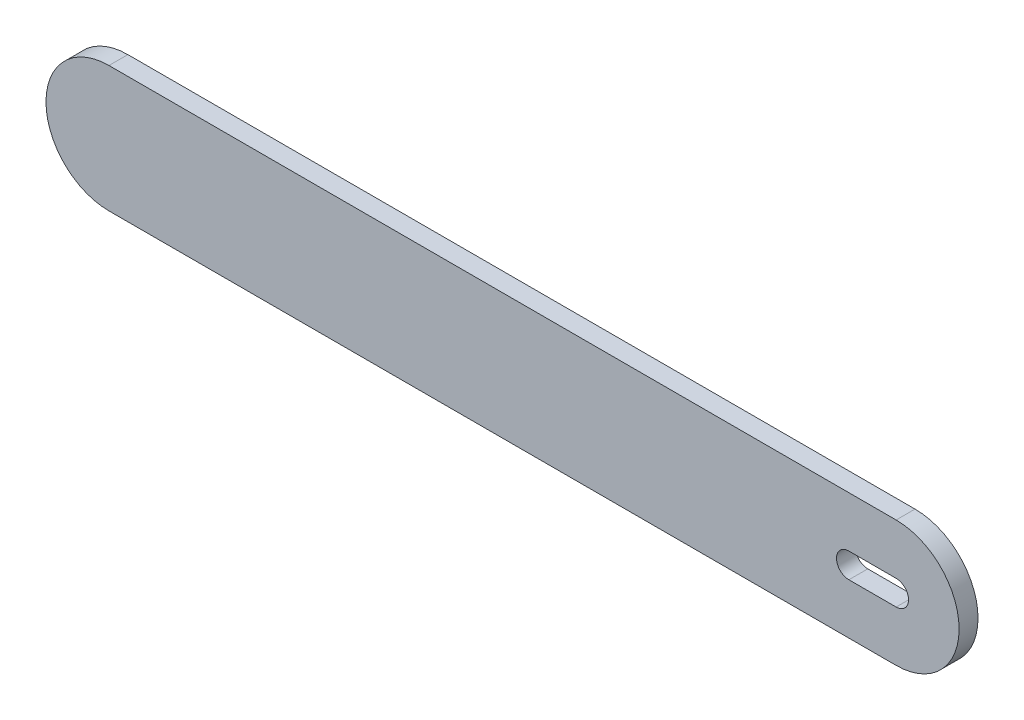
ISO-10303-21;
HEADER;
FILE_DESCRIPTION(('STEP AP214'),'2;1');
FILE_NAME('part.step','',(''),(''),'','','');
FILE_SCHEMA(('AUTOMOTIVE_DESIGN { 1 0 10303 214 1 1 1 1 }'));
ENDSEC;
DATA;
#1=APPLICATION_CONTEXT('core data for automotive mechanical design processes');
#2=APPLICATION_PROTOCOL_DEFINITION('international standard','automotive_design',2000,#1);
#3=PRODUCT_CONTEXT('',#1,'mechanical');
#4=PRODUCT('Part','Part','',(#3));
#5=PRODUCT_RELATED_PRODUCT_CATEGORY('part','',(#4));
#6=PRODUCT_DEFINITION_FORMATION('','',#4);
#7=PRODUCT_DEFINITION_CONTEXT('part definition',#1,'design');
#8=PRODUCT_DEFINITION('design','',#6,#7);
#9=PRODUCT_DEFINITION_SHAPE('','',#8);
#10=(LENGTH_UNIT() NAMED_UNIT(*) SI_UNIT(.MILLI.,.METRE.));
#11=(NAMED_UNIT(*) PLANE_ANGLE_UNIT() SI_UNIT($,.RADIAN.));
#12=(NAMED_UNIT(*) SI_UNIT($,.STERADIAN.) SOLID_ANGLE_UNIT());
#13=UNCERTAINTY_MEASURE_WITH_UNIT(LENGTH_MEASURE(1.E-05),#10,'distance_accuracy_value','');
#14=(GEOMETRIC_REPRESENTATION_CONTEXT(3) GLOBAL_UNCERTAINTY_ASSIGNED_CONTEXT((#13)) GLOBAL_UNIT_ASSIGNED_CONTEXT((#10,
#11,#12)) REPRESENTATION_CONTEXT('',''));
#15=CARTESIAN_POINT('',(0.,0.,0.));
#16=DIRECTION('',(0.,0.,1.));
#17=DIRECTION('',(1.,0.,0.));
#18=AXIS2_PLACEMENT_3D('',#15,#16,#17);
#19=CARTESIAN_POINT('',(-53.15,-0.367507574945572,6.));
#20=DIRECTION('',(0.,0.,-1.));
#21=DIRECTION('',(-1.,0.,0.));
#22=AXIS2_PLACEMENT_3D('',#19,#20,#21);
#23=CYLINDRICAL_SURFACE('',#22,20.);
#24=CARTESIAN_POINT('',(-53.15,-0.367507574945572,0.));
#25=DIRECTION('',(0.,0.,1.));
#26=DIRECTION('',(-1.,0.,0.));
#27=AXIS2_PLACEMENT_3D('',#24,#25,#26);
#28=CIRCLE('',#27,20.);
#29=CARTESIAN_POINT('',(-53.1499966396759,-20.3675075749453,0.));
#30=VERTEX_POINT('',#29);
#31=CARTESIAN_POINT('',(-53.1499966396758,19.6324924250541,0.));
#32=VERTEX_POINT('',#31);
#33=EDGE_CURVE('E119',#30,#32,#28,.T.);
#34=ORIENTED_EDGE('',*,*,#33,.T.);
#35=DIRECTION('',(0.,0.,-1.));
#36=VECTOR('',#35,1.);
#37=CARTESIAN_POINT('',(-53.1499966396758,19.6324924250541,6.));
#38=LINE('',#37,#36);
#39=CARTESIAN_POINT('',(-53.1499966396758,19.6324924250541,6.));
#40=VERTEX_POINT('',#39);
#41=EDGE_CURVE('E11',#40,#32,#38,.T.);
#42=ORIENTED_EDGE('',*,*,#41,.F.);
#43=CARTESIAN_POINT('',(-53.15,-0.367507574945572,6.));
#44=DIRECTION('',(0.,0.,1.));
#45=DIRECTION('',(-1.,0.,0.));
#46=AXIS2_PLACEMENT_3D('',#43,#44,#45);
#47=CIRCLE('',#46,20.);
#48=CARTESIAN_POINT('',(-53.1499966396759,-20.3675075749453,6.));
#49=VERTEX_POINT('',#48);
#50=EDGE_CURVE('E142',#49,#40,#47,.T.);
#51=ORIENTED_EDGE('',*,*,#50,.F.);
#52=DIRECTION('',(0.,0.,-1.));
#53=VECTOR('',#52,1.);
#54=CARTESIAN_POINT('',(-53.1499966396759,-20.3675075749453,6.));
#55=LINE('',#54,#53);
#56=EDGE_CURVE('E152',#49,#30,#55,.T.);
#57=ORIENTED_EDGE('',*,*,#56,.T.);
#58=EDGE_LOOP('',(#34,#42,#51,#57));
#59=FACE_BOUND('',#58,.T.);
#60=ADVANCED_FACE('F41',(#59),#23,.T.);
#61=CARTESIAN_POINT('',(-303.15,19.6324924250547,6.));
#62=DIRECTION('',(0.,-1.,0.));
#63=DIRECTION('',(1.,0.,0.));
#64=AXIS2_PLACEMENT_3D('',#61,#62,#63);
#65=PLANE('',#64);
#66=DIRECTION('',(-1.,0.,0.));
#67=VECTOR('',#66,1.);
#68=CARTESIAN_POINT('',(-303.15,19.6324924250547,0.));
#69=LINE('',#68,#67);
#70=CARTESIAN_POINT('',(-303.15,19.6324924250548,0.));
#71=VERTEX_POINT('',#70);
#72=EDGE_CURVE('E155',#32,#71,#69,.T.);
#73=ORIENTED_EDGE('',*,*,#72,.T.);
#74=DIRECTION('',(0.,0.,-1.));
#75=VECTOR('',#74,1.);
#76=CARTESIAN_POINT('',(-303.15,19.6324924250548,6.));
#77=LINE('',#76,#75);
#78=CARTESIAN_POINT('',(-303.15,19.6324924250548,6.));
#79=VERTEX_POINT('',#78);
#80=EDGE_CURVE('E48',#79,#71,#77,.T.);
#81=ORIENTED_EDGE('',*,*,#80,.F.);
#82=DIRECTION('',(-1.,0.,0.));
#83=VECTOR('',#82,1.);
#84=CARTESIAN_POINT('',(-303.15,19.6324924250547,6.));
#85=LINE('',#84,#83);
#86=EDGE_CURVE('E145',#40,#79,#85,.T.);
#87=ORIENTED_EDGE('',*,*,#86,.F.);
#88=ORIENTED_EDGE('',*,*,#41,.T.);
#89=EDGE_LOOP('',(#73,#81,#87,#88));
#90=FACE_BOUND('',#89,.T.);
#91=ADVANCED_FACE('F183',(#90),#65,.F.);
#92=CARTESIAN_POINT('',(-303.15,-0.367507574945326,6.));
#93=DIRECTION('',(0.,0.,-1.));
#94=DIRECTION('',(-1.,0.,0.));
#95=AXIS2_PLACEMENT_3D('',#92,#93,#94);
#96=CYLINDRICAL_SURFACE('',#95,20.0000000000001);
#97=CARTESIAN_POINT('',(-303.15,-0.367507574945326,0.));
#98=DIRECTION('',(0.,0.,1.));
#99=DIRECTION('',(-1.,0.,0.));
#100=AXIS2_PLACEMENT_3D('',#97,#98,#99);
#101=CIRCLE('',#100,20.0000000000001);
#102=CARTESIAN_POINT('',(-303.15,-20.3675075749456,0.));
#103=VERTEX_POINT('',#102);
#104=EDGE_CURVE('E157',#71,#103,#101,.T.);
#105=ORIENTED_EDGE('',*,*,#104,.T.);
#106=DIRECTION('',(0.,0.,-1.));
#107=VECTOR('',#106,1.);
#108=CARTESIAN_POINT('',(-303.15,-20.3675075749456,6.));
#109=LINE('',#108,#107);
#110=CARTESIAN_POINT('',(-303.15,-20.3675075749456,6.));
#111=VERTEX_POINT('',#110);
#112=EDGE_CURVE('E162',#111,#103,#109,.T.);
#113=ORIENTED_EDGE('',*,*,#112,.F.);
#114=CARTESIAN_POINT('',(-303.15,-0.367507574945326,6.));
#115=DIRECTION('',(0.,0.,1.));
#116=DIRECTION('',(-1.,0.,0.));
#117=AXIS2_PLACEMENT_3D('',#114,#115,#116);
#118=CIRCLE('',#117,20.0000000000001);
#119=EDGE_CURVE('E148',#79,#111,#118,.T.);
#120=ORIENTED_EDGE('',*,*,#119,.F.);
#121=ORIENTED_EDGE('',*,*,#80,.T.);
#122=EDGE_LOOP('',(#105,#113,#120,#121));
#123=FACE_BOUND('',#122,.T.);
#124=ADVANCED_FACE('F169',(#123),#96,.T.);
#125=CARTESIAN_POINT('',(-53.1499966396759,-20.3675075749453,6.));
#126=DIRECTION('',(0.,1.,0.));
#127=DIRECTION('',(-1.,0.,0.));
#128=AXIS2_PLACEMENT_3D('',#125,#126,#127);
#129=PLANE('',#128);
#130=DIRECTION('',(1.,0.,0.));
#131=VECTOR('',#130,1.);
#132=CARTESIAN_POINT('',(-53.1499966396759,-20.3675075749453,0.));
#133=LINE('',#132,#131);
#134=EDGE_CURVE('E146',#103,#30,#133,.T.);
#135=ORIENTED_EDGE('',*,*,#134,.T.);
#136=ORIENTED_EDGE('',*,*,#56,.F.);
#137=DIRECTION('',(1.,0.,0.));
#138=VECTOR('',#137,1.);
#139=CARTESIAN_POINT('',(-53.1499966396759,-20.3675075749453,6.));
#140=LINE('',#139,#138);
#141=EDGE_CURVE('E150',#111,#49,#140,.T.);
#142=ORIENTED_EDGE('',*,*,#141,.F.);
#143=ORIENTED_EDGE('',*,*,#112,.T.);
#144=EDGE_LOOP('',(#135,#136,#142,#143));
#145=FACE_BOUND('',#144,.T.);
#146=ADVANCED_FACE('F178',(#145),#129,.F.);
#147=CARTESIAN_POINT('',(-53.15,-0.367507574945572,6.));
#148=DIRECTION('',(0.,0.,-1.));
#149=DIRECTION('',(-1.,0.,0.));
#150=AXIS2_PLACEMENT_3D('',#147,#148,#149);
#151=PLANE('',#150);
#152=DIRECTION('',(-1.,0.,0.));
#153=VECTOR('',#152,1.);
#154=CARTESIAN_POINT('',(-53.1500000000005,3.57626302207883,6.));
#155=LINE('',#154,#153);
#156=CARTESIAN_POINT('',(-53.1500000000005,3.57626302207883,6.));
#157=VERTEX_POINT('',#156);
#158=CARTESIAN_POINT('',(-68.1500000000005,3.57626302207883,6.));
#159=VERTEX_POINT('',#158);
#160=EDGE_CURVE('E125',#157,#159,#155,.T.);
#161=ORIENTED_EDGE('',*,*,#160,.F.);
#162=CARTESIAN_POINT('',(-53.1500000000009,-0.367507574945548,6.));
#163=DIRECTION('',(0.,0.,-1.));
#164=DIRECTION('',(-1.,0.,0.));
#165=AXIS2_PLACEMENT_3D('',#162,#163,#164);
#166=CIRCLE('',#165,3.9437705970244);
#167=CARTESIAN_POINT('',(-53.1500000000005,-4.31127817196997,6.));
#168=VERTEX_POINT('',#167);
#169=EDGE_CURVE('E107',#168,#157,#166,.F.);
#170=ORIENTED_EDGE('',*,*,#169,.F.);
#171=DIRECTION('',(1.,0.,0.));
#172=VECTOR('',#171,1.);
#173=CARTESIAN_POINT('',(-53.1500000000005,-4.31127817196997,6.));
#174=LINE('',#173,#172);
#175=CARTESIAN_POINT('',(-68.1500000000005,-4.31127817196997,6.));
#176=VERTEX_POINT('',#175);
#177=EDGE_CURVE('E116',#176,#168,#174,.T.);
#178=ORIENTED_EDGE('',*,*,#177,.F.);
#179=CARTESIAN_POINT('',(-68.1500000000005,-0.367507574945572,6.));
#180=DIRECTION('',(0.,0.,-1.));
#181=DIRECTION('',(-1.,0.,0.));
#182=AXIS2_PLACEMENT_3D('',#179,#180,#181);
#183=CIRCLE('',#182,3.9437705970244);
#184=EDGE_CURVE('E55',#159,#176,#183,.F.);
#185=ORIENTED_EDGE('',*,*,#184,.F.);
#186=EDGE_LOOP('',(#161,#170,#178,#185));
#187=FACE_BOUND('',#186,.T.);
#188=ORIENTED_EDGE('',*,*,#50,.T.);
#189=ORIENTED_EDGE('',*,*,#86,.T.);
#190=ORIENTED_EDGE('',*,*,#119,.T.);
#191=ORIENTED_EDGE('',*,*,#141,.T.);
#192=EDGE_LOOP('',(#188,#189,#190,#191));
#193=FACE_BOUND('',#192,.T.);
#194=ADVANCED_FACE('F122',(#187,#193),#151,.F.);
#195=CARTESIAN_POINT('',(-53.15,-0.367507574945572,0.));
#196=DIRECTION('',(0.,0.,-1.));
#197=DIRECTION('',(-1.,0.,0.));
#198=AXIS2_PLACEMENT_3D('',#195,#196,#197);
#199=PLANE('',#198);
#200=CARTESIAN_POINT('',(-53.1500000000009,-0.367507574945548,0.));
#201=DIRECTION('',(0.,0.,-1.));
#202=DIRECTION('',(-1.,0.,0.));
#203=AXIS2_PLACEMENT_3D('',#200,#201,#202);
#204=CIRCLE('',#203,3.9437705970244);
#205=CARTESIAN_POINT('',(-53.1500000000005,3.57626302207883,0.));
#206=VERTEX_POINT('',#205);
#207=CARTESIAN_POINT('',(-53.1500000000005,-4.31127817196997,0.));
#208=VERTEX_POINT('',#207);
#209=EDGE_CURVE('E63',#206,#208,#204,.T.);
#210=ORIENTED_EDGE('',*,*,#209,.F.);
#211=DIRECTION('',(1.,0.,0.));
#212=VECTOR('',#211,1.);
#213=CARTESIAN_POINT('',(-53.1500000000005,3.57626302207883,0.));
#214=LINE('',#213,#212);
#215=CARTESIAN_POINT('',(-68.1500000000005,3.57626302207883,0.));
#216=VERTEX_POINT('',#215);
#217=EDGE_CURVE('E113',#216,#206,#214,.T.);
#218=ORIENTED_EDGE('',*,*,#217,.F.);
#219=CARTESIAN_POINT('',(-68.1500000000005,-0.367507574945572,0.));
#220=DIRECTION('',(0.,0.,-1.));
#221=DIRECTION('',(-1.,0.,0.));
#222=AXIS2_PLACEMENT_3D('',#219,#220,#221);
#223=CIRCLE('',#222,3.9437705970244);
#224=CARTESIAN_POINT('',(-68.1500000000005,-4.31127817196997,0.));
#225=VERTEX_POINT('',#224);
#226=EDGE_CURVE('E133',#225,#216,#223,.T.);
#227=ORIENTED_EDGE('',*,*,#226,.F.);
#228=DIRECTION('',(-1.,0.,0.));
#229=VECTOR('',#228,1.);
#230=CARTESIAN_POINT('',(-53.1500000000005,-4.31127817196997,0.));
#231=LINE('',#230,#229);
#232=EDGE_CURVE('E127',#208,#225,#231,.T.);
#233=ORIENTED_EDGE('',*,*,#232,.F.);
#234=EDGE_LOOP('',(#210,#218,#227,#233));
#235=FACE_BOUND('',#234,.T.);
#236=ORIENTED_EDGE('',*,*,#33,.F.);
#237=ORIENTED_EDGE('',*,*,#134,.F.);
#238=ORIENTED_EDGE('',*,*,#104,.F.);
#239=ORIENTED_EDGE('',*,*,#72,.F.);
#240=EDGE_LOOP('',(#236,#237,#238,#239));
#241=FACE_BOUND('',#240,.T.);
#242=ADVANCED_FACE('F175',(#235,#241),#199,.T.);
#243=CARTESIAN_POINT('',(-53.1500000000009,-0.367507574945548,6.001));
#244=DIRECTION('',(0.,0.,-1.));
#245=DIRECTION('',(-1.,0.,0.));
#246=AXIS2_PLACEMENT_3D('',#243,#244,#245);
#247=CYLINDRICAL_SURFACE('',#246,3.9437705970244);
#248=ORIENTED_EDGE('',*,*,#169,.T.);
#249=DIRECTION('',(0.,0.,-1.));
#250=VECTOR('',#249,1.);
#251=CARTESIAN_POINT('',(-53.1500000000005,3.57626302207883,6.001));
#252=LINE('',#251,#250);
#253=EDGE_CURVE('E120',#157,#206,#252,.T.);
#254=ORIENTED_EDGE('',*,*,#253,.T.);
#255=ORIENTED_EDGE('',*,*,#209,.T.);
#256=DIRECTION('',(0.,0.,-1.));
#257=VECTOR('',#256,1.);
#258=CARTESIAN_POINT('',(-53.1500000000005,-4.31127817196997,6.001));
#259=LINE('',#258,#257);
#260=EDGE_CURVE('E103',#168,#208,#259,.T.);
#261=ORIENTED_EDGE('',*,*,#260,.F.);
#262=EDGE_LOOP('',(#248,#254,#255,#261));
#263=FACE_BOUND('',#262,.T.);
#264=ADVANCED_FACE('F105',(#263),#247,.F.);
#265=CARTESIAN_POINT('',(-53.1500000000005,3.57626302207883,6.001));
#266=DIRECTION('',(0.,1.,0.));
#267=DIRECTION('',(0.,0.,1.));
#268=AXIS2_PLACEMENT_3D('',#265,#266,#267);
#269=PLANE('',#268);
#270=ORIENTED_EDGE('',*,*,#160,.T.);
#271=DIRECTION('',(0.,0.,-1.));
#272=VECTOR('',#271,1.);
#273=CARTESIAN_POINT('',(-68.1500000000005,3.57626302207883,6.001));
#274=LINE('',#273,#272);
#275=EDGE_CURVE('E139',#159,#216,#274,.T.);
#276=ORIENTED_EDGE('',*,*,#275,.T.);
#277=ORIENTED_EDGE('',*,*,#217,.T.);
#278=ORIENTED_EDGE('',*,*,#253,.F.);
#279=EDGE_LOOP('',(#270,#276,#277,#278));
#280=FACE_BOUND('',#279,.T.);
#281=ADVANCED_FACE('F200',(#280),#269,.F.);
#282=CARTESIAN_POINT('',(-68.1500000000005,-0.367507574945572,6.001));
#283=DIRECTION('',(0.,0.,-1.));
#284=DIRECTION('',(-1.,0.,0.));
#285=AXIS2_PLACEMENT_3D('',#282,#283,#284);
#286=CYLINDRICAL_SURFACE('',#285,3.9437705970244);
#287=ORIENTED_EDGE('',*,*,#184,.T.);
#288=DIRECTION('',(0.,0.,-1.));
#289=VECTOR('',#288,1.);
#290=CARTESIAN_POINT('',(-68.1500000000005,-4.31127817196997,6.001));
#291=LINE('',#290,#289);
#292=EDGE_CURVE('E112',#176,#225,#291,.T.);
#293=ORIENTED_EDGE('',*,*,#292,.T.);
#294=ORIENTED_EDGE('',*,*,#226,.T.);
#295=ORIENTED_EDGE('',*,*,#275,.F.);
#296=EDGE_LOOP('',(#287,#293,#294,#295));
#297=FACE_BOUND('',#296,.T.);
#298=ADVANCED_FACE('F203',(#297),#286,.F.);
#299=CARTESIAN_POINT('',(-53.1500000000005,-4.31127817196997,6.001));
#300=DIRECTION('',(0.,-1.,0.));
#301=DIRECTION('',(0.,0.,-1.));
#302=AXIS2_PLACEMENT_3D('',#299,#300,#301);
#303=PLANE('',#302);
#304=ORIENTED_EDGE('',*,*,#177,.T.);
#305=ORIENTED_EDGE('',*,*,#260,.T.);
#306=ORIENTED_EDGE('',*,*,#232,.T.);
#307=ORIENTED_EDGE('',*,*,#292,.F.);
#308=EDGE_LOOP('',(#304,#305,#306,#307));
#309=FACE_BOUND('',#308,.T.);
#310=ADVANCED_FACE('F117',(#309),#303,.F.);
#311=CLOSED_SHELL('',(#60,#91,#124,#146,#194,#242,#264,#281,#298,#310));
#312=MANIFOLD_SOLID_BREP('B2',#311);
#313=ADVANCED_BREP_SHAPE_REPRESENTATION('',(#18,#312),#14);
#314=SHAPE_DEFINITION_REPRESENTATION(#9,#313);
ENDSEC;
END-ISO-10303-21;
